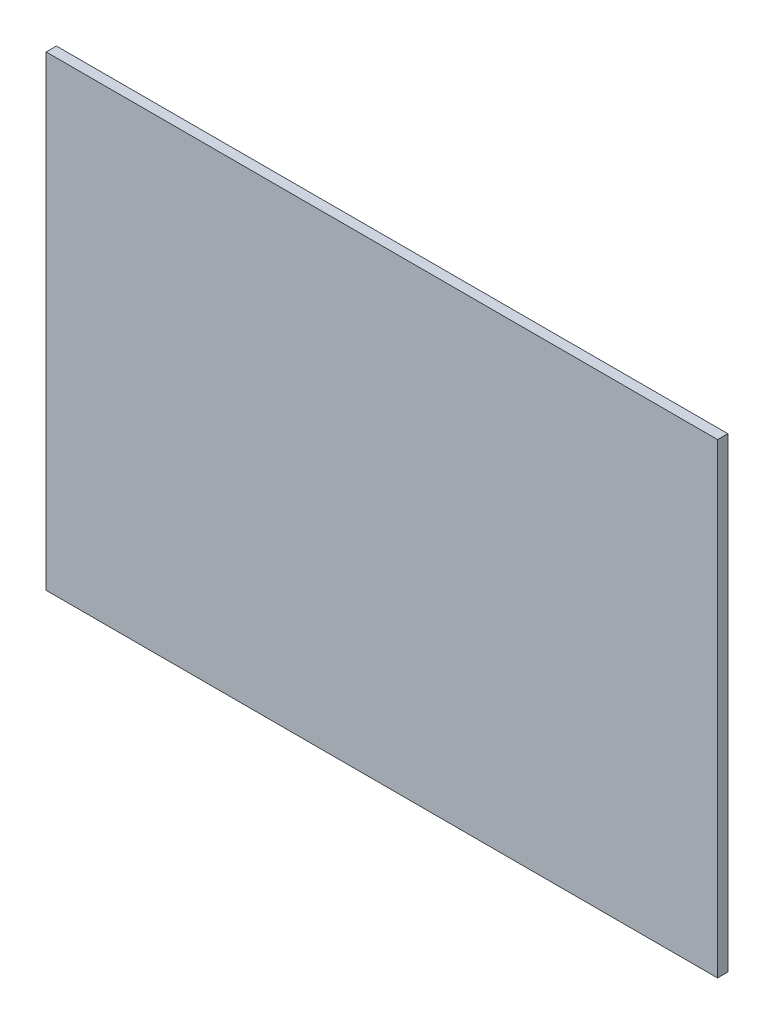
ISO-10303-21;
HEADER;
FILE_DESCRIPTION(('STEP AP214'),'2;1');
FILE_NAME('part.step','',(''),(''),'','','');
FILE_SCHEMA(('AUTOMOTIVE_DESIGN { 1 0 10303 214 1 1 1 1 }'));
ENDSEC;
DATA;
#1=APPLICATION_CONTEXT('core data for automotive mechanical design processes');
#2=APPLICATION_PROTOCOL_DEFINITION('international standard','automotive_design',2000,#1);
#3=PRODUCT_CONTEXT('',#1,'mechanical');
#4=PRODUCT('Part','Part','',(#3));
#5=PRODUCT_RELATED_PRODUCT_CATEGORY('part','',(#4));
#6=PRODUCT_DEFINITION_FORMATION('','',#4);
#7=PRODUCT_DEFINITION_CONTEXT('part definition',#1,'design');
#8=PRODUCT_DEFINITION('design','',#6,#7);
#9=PRODUCT_DEFINITION_SHAPE('','',#8);
#10=(LENGTH_UNIT() NAMED_UNIT(*) SI_UNIT(.MILLI.,.METRE.));
#11=(NAMED_UNIT(*) PLANE_ANGLE_UNIT() SI_UNIT($,.RADIAN.));
#12=(NAMED_UNIT(*) SI_UNIT($,.STERADIAN.) SOLID_ANGLE_UNIT());
#13=UNCERTAINTY_MEASURE_WITH_UNIT(LENGTH_MEASURE(1.E-05),#10,'distance_accuracy_value','');
#14=(GEOMETRIC_REPRESENTATION_CONTEXT(3) GLOBAL_UNCERTAINTY_ASSIGNED_CONTEXT((#13)) GLOBAL_UNIT_ASSIGNED_CONTEXT((#10,
#11,#12)) REPRESENTATION_CONTEXT('',''));
#15=CARTESIAN_POINT('',(0.,0.,0.));
#16=DIRECTION('',(0.,0.,1.));
#17=DIRECTION('',(1.,0.,0.));
#18=AXIS2_PLACEMENT_3D('',#15,#16,#17);
#19=CARTESIAN_POINT('',(-25.,25.,1.1));
#20=DIRECTION('',(1.,0.,0.));
#21=DIRECTION('',(0.,1.,0.));
#22=AXIS2_PLACEMENT_3D('',#19,#20,#21);
#23=PLANE('',#22);
#24=DIRECTION('',(0.,-1.,0.));
#25=VECTOR('',#24,1.);
#26=CARTESIAN_POINT('',(-25.,25.,0.));
#27=LINE('',#26,#25);
#28=CARTESIAN_POINT('',(-25.,25.,0.));
#29=VERTEX_POINT('',#28);
#30=CARTESIAN_POINT('',(-25.,-25.,0.));
#31=VERTEX_POINT('',#30);
#32=EDGE_CURVE('E96',#29,#31,#27,.T.);
#33=ORIENTED_EDGE('',*,*,#32,.T.);
#34=DIRECTION('',(0.,0.,-1.));
#35=VECTOR('',#34,1.);
#36=CARTESIAN_POINT('',(-25.,-25.,1.1));
#37=LINE('',#36,#35);
#38=CARTESIAN_POINT('',(-25.,-25.,1.1));
#39=VERTEX_POINT('',#38);
#40=EDGE_CURVE('E11',#39,#31,#37,.T.);
#41=ORIENTED_EDGE('',*,*,#40,.F.);
#42=DIRECTION('',(0.,-1.,0.));
#43=VECTOR('',#42,1.);
#44=CARTESIAN_POINT('',(-25.,25.,1.1));
#45=LINE('',#44,#43);
#46=CARTESIAN_POINT('',(-25.,25.,1.1));
#47=VERTEX_POINT('',#46);
#48=EDGE_CURVE('E84',#47,#39,#45,.T.);
#49=ORIENTED_EDGE('',*,*,#48,.F.);
#50=DIRECTION('',(0.,0.,-1.));
#51=VECTOR('',#50,1.);
#52=CARTESIAN_POINT('',(-25.,25.,1.1));
#53=LINE('',#52,#51);
#54=EDGE_CURVE('E92',#47,#29,#53,.T.);
#55=ORIENTED_EDGE('',*,*,#54,.T.);
#56=EDGE_LOOP('',(#33,#41,#49,#55));
#57=FACE_BOUND('',#56,.T.);
#58=ADVANCED_FACE('F33',(#57),#23,.F.);
#59=CARTESIAN_POINT('',(-25.,-25.,1.1));
#60=DIRECTION('',(0.,1.,0.));
#61=DIRECTION('',(0.,0.,1.));
#62=AXIS2_PLACEMENT_3D('',#59,#60,#61);
#63=PLANE('',#62);
#64=DIRECTION('',(1.,0.,0.));
#65=VECTOR('',#64,1.);
#66=CARTESIAN_POINT('',(-25.,-25.,0.));
#67=LINE('',#66,#65);
#68=CARTESIAN_POINT('',(47.,-25.,0.));
#69=VERTEX_POINT('',#68);
#70=EDGE_CURVE('E88',#31,#69,#67,.T.);
#71=ORIENTED_EDGE('',*,*,#70,.T.);
#72=DIRECTION('',(0.,0.,-1.));
#73=VECTOR('',#72,1.);
#74=CARTESIAN_POINT('',(47.,-25.,1.1));
#75=LINE('',#74,#73);
#76=CARTESIAN_POINT('',(47.,-25.,1.1));
#77=VERTEX_POINT('',#76);
#78=EDGE_CURVE('E41',#77,#69,#75,.T.);
#79=ORIENTED_EDGE('',*,*,#78,.F.);
#80=DIRECTION('',(1.,0.,0.));
#81=VECTOR('',#80,1.);
#82=CARTESIAN_POINT('',(-25.,-25.,1.1));
#83=LINE('',#82,#81);
#84=EDGE_CURVE('E79',#39,#77,#83,.T.);
#85=ORIENTED_EDGE('',*,*,#84,.F.);
#86=ORIENTED_EDGE('',*,*,#40,.T.);
#87=EDGE_LOOP('',(#71,#79,#85,#86));
#88=FACE_BOUND('',#87,.T.);
#89=ADVANCED_FACE('F87',(#88),#63,.F.);
#90=CARTESIAN_POINT('',(47.,25.,1.1));
#91=DIRECTION('',(-1.,0.,0.));
#92=DIRECTION('',(0.,-1.,0.));
#93=AXIS2_PLACEMENT_3D('',#90,#91,#92);
#94=PLANE('',#93);
#95=DIRECTION('',(0.,1.,0.));
#96=VECTOR('',#95,1.);
#97=CARTESIAN_POINT('',(47.,25.,0.));
#98=LINE('',#97,#96);
#99=CARTESIAN_POINT('',(47.,25.,0.));
#100=VERTEX_POINT('',#99);
#101=EDGE_CURVE('E66',#69,#100,#98,.T.);
#102=ORIENTED_EDGE('',*,*,#101,.T.);
#103=DIRECTION('',(0.,0.,-1.));
#104=VECTOR('',#103,1.);
#105=CARTESIAN_POINT('',(47.,25.,1.1));
#106=LINE('',#105,#104);
#107=CARTESIAN_POINT('',(47.,25.,1.1));
#108=VERTEX_POINT('',#107);
#109=EDGE_CURVE('E89',#108,#100,#106,.T.);
#110=ORIENTED_EDGE('',*,*,#109,.F.);
#111=DIRECTION('',(0.,1.,0.));
#112=VECTOR('',#111,1.);
#113=CARTESIAN_POINT('',(47.,25.,1.1));
#114=LINE('',#113,#112);
#115=EDGE_CURVE('E82',#77,#108,#114,.T.);
#116=ORIENTED_EDGE('',*,*,#115,.F.);
#117=ORIENTED_EDGE('',*,*,#78,.T.);
#118=EDGE_LOOP('',(#102,#110,#116,#117));
#119=FACE_BOUND('',#118,.T.);
#120=ADVANCED_FACE('F90',(#119),#94,.F.);
#121=CARTESIAN_POINT('',(-25.,25.,1.1));
#122=DIRECTION('',(0.,-1.,0.));
#123=DIRECTION('',(0.,0.,-1.));
#124=AXIS2_PLACEMENT_3D('',#121,#122,#123);
#125=PLANE('',#124);
#126=DIRECTION('',(-1.,0.,0.));
#127=VECTOR('',#126,1.);
#128=CARTESIAN_POINT('',(-25.,25.,0.));
#129=LINE('',#128,#127);
#130=EDGE_CURVE('E72',#100,#29,#129,.T.);
#131=ORIENTED_EDGE('',*,*,#130,.T.);
#132=ORIENTED_EDGE('',*,*,#54,.F.);
#133=DIRECTION('',(-1.,0.,0.));
#134=VECTOR('',#133,1.);
#135=CARTESIAN_POINT('',(-25.,25.,1.1));
#136=LINE('',#135,#134);
#137=EDGE_CURVE('E49',#108,#47,#136,.T.);
#138=ORIENTED_EDGE('',*,*,#137,.F.);
#139=ORIENTED_EDGE('',*,*,#109,.T.);
#140=EDGE_LOOP('',(#131,#132,#138,#139));
#141=FACE_BOUND('',#140,.T.);
#142=ADVANCED_FACE('F103',(#141),#125,.F.);
#143=CARTESIAN_POINT('',(0.,0.,1.1));
#144=DIRECTION('',(0.,0.,1.));
#145=DIRECTION('',(1.,0.,0.));
#146=AXIS2_PLACEMENT_3D('',#143,#144,#145);
#147=PLANE('',#146);
#148=ORIENTED_EDGE('',*,*,#48,.T.);
#149=ORIENTED_EDGE('',*,*,#84,.T.);
#150=ORIENTED_EDGE('',*,*,#115,.T.);
#151=ORIENTED_EDGE('',*,*,#137,.T.);
#152=EDGE_LOOP('',(#148,#149,#150,#151));
#153=FACE_BOUND('',#152,.T.);
#154=ADVANCED_FACE('F80',(#153),#147,.T.);
#155=CARTESIAN_POINT('',(0.,0.,0.));
#156=DIRECTION('',(0.,0.,1.));
#157=DIRECTION('',(1.,0.,0.));
#158=AXIS2_PLACEMENT_3D('',#155,#156,#157);
#159=PLANE('',#158);
#160=ORIENTED_EDGE('',*,*,#32,.F.);
#161=ORIENTED_EDGE('',*,*,#130,.F.);
#162=ORIENTED_EDGE('',*,*,#101,.F.);
#163=ORIENTED_EDGE('',*,*,#70,.F.);
#164=EDGE_LOOP('',(#160,#161,#162,#163));
#165=FACE_BOUND('',#164,.T.);
#166=ADVANCED_FACE('F106',(#165),#159,.F.);
#167=CLOSED_SHELL('',(#58,#89,#120,#142,#154,#166));
#168=MANIFOLD_SOLID_BREP('B2',#167);
#169=ADVANCED_BREP_SHAPE_REPRESENTATION('',(#18,#168),#14);
#170=SHAPE_DEFINITION_REPRESENTATION(#9,#169);
ENDSEC;
END-ISO-10303-21;
